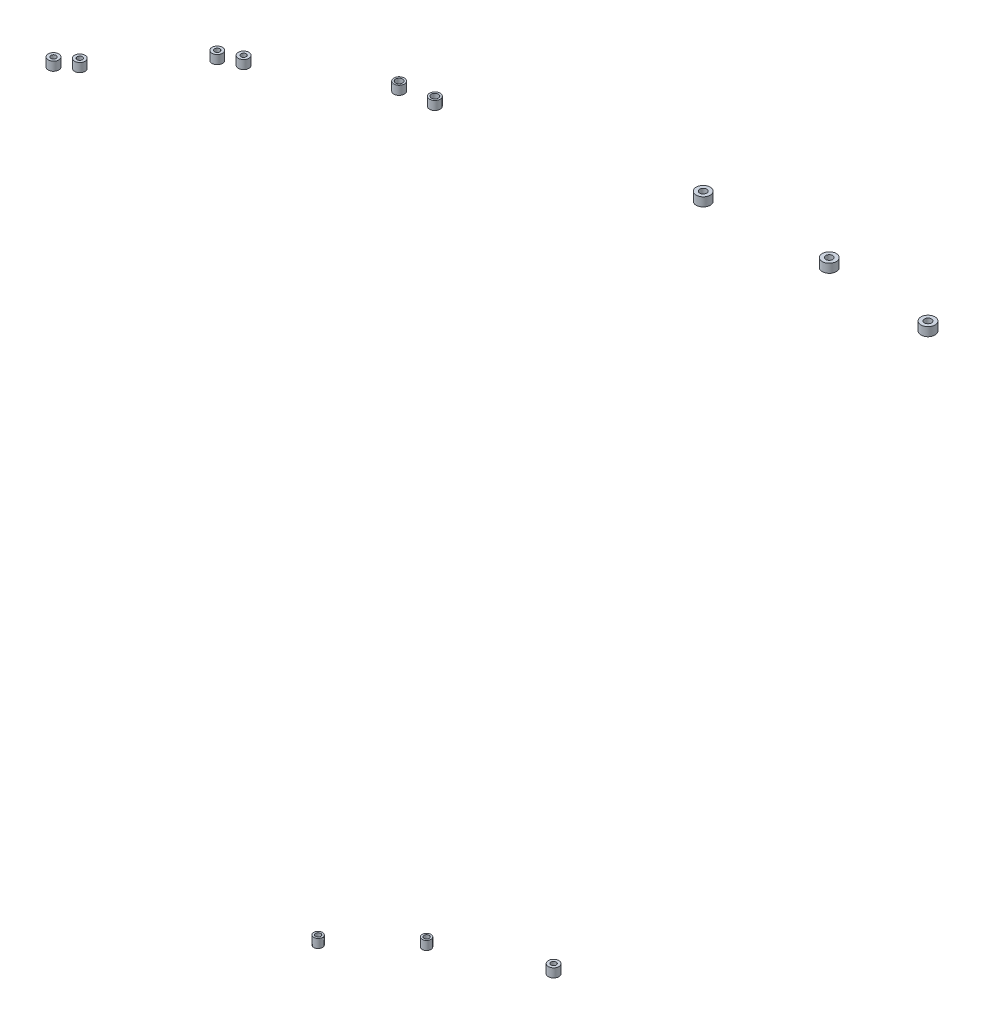
ISO-10303-21;
HEADER;
FILE_DESCRIPTION(('STEP AP214'),'2;1');
FILE_NAME('part.step','',(''),(''),'','','');
FILE_SCHEMA(('AUTOMOTIVE_DESIGN { 1 0 10303 214 1 1 1 1 }'));
ENDSEC;
DATA;
#1=APPLICATION_CONTEXT('core data for automotive mechanical design processes');
#2=APPLICATION_PROTOCOL_DEFINITION('international standard','automotive_design',2000,#1);
#3=PRODUCT_CONTEXT('',#1,'mechanical');
#4=PRODUCT('Part','Part','',(#3));
#5=PRODUCT_RELATED_PRODUCT_CATEGORY('part','',(#4));
#6=PRODUCT_DEFINITION_FORMATION('','',#4);
#7=PRODUCT_DEFINITION_CONTEXT('part definition',#1,'design');
#8=PRODUCT_DEFINITION('design','',#6,#7);
#9=PRODUCT_DEFINITION_SHAPE('','',#8);
#10=(LENGTH_UNIT() NAMED_UNIT(*) SI_UNIT(.MILLI.,.METRE.));
#11=(NAMED_UNIT(*) PLANE_ANGLE_UNIT() SI_UNIT($,.RADIAN.));
#12=(NAMED_UNIT(*) SI_UNIT($,.STERADIAN.) SOLID_ANGLE_UNIT());
#13=UNCERTAINTY_MEASURE_WITH_UNIT(LENGTH_MEASURE(1.E-05),#10,'distance_accuracy_value','');
#14=(GEOMETRIC_REPRESENTATION_CONTEXT(3) GLOBAL_UNCERTAINTY_ASSIGNED_CONTEXT((#13)) GLOBAL_UNIT_ASSIGNED_CONTEXT((#10,
#11,#12)) REPRESENTATION_CONTEXT('',''));
#15=CARTESIAN_POINT('',(0.,0.,0.));
#16=DIRECTION('',(0.,0.,1.));
#17=DIRECTION('',(1.,0.,0.));
#18=AXIS2_PLACEMENT_3D('',#15,#16,#17);
#19=CARTESIAN_POINT('',(-339.082998520851,299.7,305.429754445409));
#20=DIRECTION('',(0.,-1.,0.));
#21=DIRECTION('',(0.,0.,-1.));
#22=AXIS2_PLACEMENT_3D('',#19,#20,#21);
#23=CYLINDRICAL_SURFACE('',#22,2.50000000000002);
#24=CARTESIAN_POINT('',(-339.082998520851,299.7,305.429754445409));
#25=DIRECTION('',(0.,-1.,0.));
#26=DIRECTION('',(0.,0.,-1.));
#27=AXIS2_PLACEMENT_3D('',#24,#25,#26);
#28=CIRCLE('',#27,2.50000000000002);
#29=CARTESIAN_POINT('',(-339.082998520851,299.7,302.929754445409));
#30=VERTEX_POINT('',#29);
#31=EDGE_CURVE('E11',#30,#30,#28,.T.);
#32=ORIENTED_EDGE('',*,*,#31,.T.);
#33=EDGE_LOOP('',(#32));
#34=FACE_BOUND('',#33,.T.);
#35=CARTESIAN_POINT('',(-339.082998520851,294.7,305.429754445409));
#36=DIRECTION('',(0.,-1.,0.));
#37=DIRECTION('',(0.,0.,-1.));
#38=AXIS2_PLACEMENT_3D('',#35,#36,#37);
#39=CIRCLE('',#38,2.50000000000002);
#40=CARTESIAN_POINT('',(-339.082998520851,294.7,302.929754445409));
#41=VERTEX_POINT('',#40);
#42=EDGE_CURVE('E44',#41,#41,#39,.T.);
#43=ORIENTED_EDGE('',*,*,#42,.F.);
#44=EDGE_LOOP('',(#43));
#45=FACE_BOUND('',#44,.T.);
#46=ADVANCED_FACE('F41',(#34,#45),#23,.T.);
#47=CARTESIAN_POINT('',(-339.082998520851,299.7,305.429754445409));
#48=DIRECTION('',(0.,-1.,0.));
#49=DIRECTION('',(0.,0.,-1.));
#50=AXIS2_PLACEMENT_3D('',#47,#48,#49);
#51=PLANE('',#50);
#52=CARTESIAN_POINT('',(-339.082998520851,299.7,305.429754445409));
#53=DIRECTION('',(0.,-1.,0.));
#54=DIRECTION('',(0.,0.,-1.));
#55=AXIS2_PLACEMENT_3D('',#52,#53,#54);
#56=CIRCLE('',#55,1.50000000000002);
#57=CARTESIAN_POINT('',(-339.082998520851,299.7,303.929754445409));
#58=VERTEX_POINT('',#57);
#59=EDGE_CURVE('E51',#58,#58,#56,.T.);
#60=ORIENTED_EDGE('',*,*,#59,.T.);
#61=EDGE_LOOP('',(#60));
#62=FACE_BOUND('',#61,.T.);
#63=ORIENTED_EDGE('',*,*,#31,.F.);
#64=EDGE_LOOP('',(#63));
#65=FACE_BOUND('',#64,.T.);
#66=ADVANCED_FACE('F59',(#62,#65),#51,.F.);
#67=CARTESIAN_POINT('',(-339.082998520851,294.7,305.429754445409));
#68=DIRECTION('',(0.,-1.,0.));
#69=DIRECTION('',(0.,0.,-1.));
#70=AXIS2_PLACEMENT_3D('',#67,#68,#69);
#71=PLANE('',#70);
#72=CARTESIAN_POINT('',(-339.082998520851,294.7,305.429754445409));
#73=DIRECTION('',(0.,-1.,0.));
#74=DIRECTION('',(0.,0.,-1.));
#75=AXIS2_PLACEMENT_3D('',#72,#73,#74);
#76=CIRCLE('',#75,1.50000000000002);
#77=CARTESIAN_POINT('',(-339.082998520851,294.7,303.929754445409));
#78=VERTEX_POINT('',#77);
#79=EDGE_CURVE('E53',#78,#78,#76,.T.);
#80=ORIENTED_EDGE('',*,*,#79,.F.);
#81=EDGE_LOOP('',(#80));
#82=FACE_BOUND('',#81,.T.);
#83=ORIENTED_EDGE('',*,*,#42,.T.);
#84=EDGE_LOOP('',(#83));
#85=FACE_BOUND('',#84,.T.);
#86=ADVANCED_FACE('F65',(#82,#85),#71,.T.);
#87=CARTESIAN_POINT('',(-339.082998520851,299.7,305.429754445409));
#88=DIRECTION('',(0.,-1.,0.));
#89=DIRECTION('',(0.,0.,-1.));
#90=AXIS2_PLACEMENT_3D('',#87,#88,#89);
#91=CYLINDRICAL_SURFACE('',#90,1.50000000000002);
#92=ORIENTED_EDGE('',*,*,#59,.F.);
#93=EDGE_LOOP('',(#92));
#94=FACE_BOUND('',#93,.T.);
#95=ORIENTED_EDGE('',*,*,#79,.T.);
#96=EDGE_LOOP('',(#95));
#97=FACE_BOUND('',#96,.T.);
#98=ADVANCED_FACE('F62',(#94,#97),#91,.F.);
#99=CLOSED_SHELL('',(#46,#66,#86,#98));
#100=MANIFOLD_SOLID_BREP('B2',#99);
#101=CARTESIAN_POINT('',(-289.687055909534,299.7,282.424125212571));
#102=DIRECTION('',(0.,-1.,0.));
#103=DIRECTION('',(0.,0.,-1.));
#104=AXIS2_PLACEMENT_3D('',#101,#102,#103);
#105=CYLINDRICAL_SURFACE('',#104,2.99999999999999);
#106=CARTESIAN_POINT('',(-289.687055909534,299.7,282.424125212571));
#107=DIRECTION('',(0.,-1.,0.));
#108=DIRECTION('',(0.,0.,-1.));
#109=AXIS2_PLACEMENT_3D('',#106,#107,#108);
#110=CIRCLE('',#109,2.99999999999999);
#111=CARTESIAN_POINT('',(-289.687055909534,299.7,279.424125212571));
#112=VERTEX_POINT('',#111);
#113=EDGE_CURVE('E40',#112,#112,#110,.T.);
#114=ORIENTED_EDGE('',*,*,#113,.T.);
#115=EDGE_LOOP('',(#114));
#116=FACE_BOUND('',#115,.T.);
#117=CARTESIAN_POINT('',(-289.687055909534,294.7,282.424125212571));
#118=DIRECTION('',(0.,-1.,0.));
#119=DIRECTION('',(0.,0.,-1.));
#120=AXIS2_PLACEMENT_3D('',#117,#118,#119);
#121=CIRCLE('',#120,2.99999999999999);
#122=CARTESIAN_POINT('',(-289.687055909534,294.7,279.424125212571));
#123=VERTEX_POINT('',#122);
#124=EDGE_CURVE('E113',#123,#123,#121,.T.);
#125=ORIENTED_EDGE('',*,*,#124,.F.);
#126=EDGE_LOOP('',(#125));
#127=FACE_BOUND('',#126,.T.);
#128=ADVANCED_FACE('F110',(#116,#127),#105,.T.);
#129=CARTESIAN_POINT('',(-289.687055909534,299.7,282.424125212571));
#130=DIRECTION('',(0.,-1.,0.));
#131=DIRECTION('',(0.,0.,-1.));
#132=AXIS2_PLACEMENT_3D('',#129,#130,#131);
#133=PLANE('',#132);
#134=CARTESIAN_POINT('',(-289.687055909534,299.7,282.424125212571));
#135=DIRECTION('',(0.,-1.,0.));
#136=DIRECTION('',(0.,0.,-1.));
#137=AXIS2_PLACEMENT_3D('',#134,#135,#136);
#138=CIRCLE('',#137,1.50000000000002);
#139=CARTESIAN_POINT('',(-289.687055909534,299.7,280.924125212571));
#140=VERTEX_POINT('',#139);
#141=EDGE_CURVE('E120',#140,#140,#138,.T.);
#142=ORIENTED_EDGE('',*,*,#141,.T.);
#143=EDGE_LOOP('',(#142));
#144=FACE_BOUND('',#143,.T.);
#145=ORIENTED_EDGE('',*,*,#113,.F.);
#146=EDGE_LOOP('',(#145));
#147=FACE_BOUND('',#146,.T.);
#148=ADVANCED_FACE('F128',(#144,#147),#133,.F.);
#149=CARTESIAN_POINT('',(-289.687055909534,294.7,282.424125212571));
#150=DIRECTION('',(0.,-1.,0.));
#151=DIRECTION('',(0.,0.,-1.));
#152=AXIS2_PLACEMENT_3D('',#149,#150,#151);
#153=PLANE('',#152);
#154=CARTESIAN_POINT('',(-289.687055909534,294.7,282.424125212571));
#155=DIRECTION('',(0.,-1.,0.));
#156=DIRECTION('',(0.,0.,-1.));
#157=AXIS2_PLACEMENT_3D('',#154,#155,#156);
#158=CIRCLE('',#157,1.50000000000002);
#159=CARTESIAN_POINT('',(-289.687055909534,294.7,280.924125212571));
#160=VERTEX_POINT('',#159);
#161=EDGE_CURVE('E122',#160,#160,#158,.T.);
#162=ORIENTED_EDGE('',*,*,#161,.F.);
#163=EDGE_LOOP('',(#162));
#164=FACE_BOUND('',#163,.T.);
#165=ORIENTED_EDGE('',*,*,#124,.T.);
#166=EDGE_LOOP('',(#165));
#167=FACE_BOUND('',#166,.T.);
#168=ADVANCED_FACE('F134',(#164,#167),#153,.T.);
#169=CARTESIAN_POINT('',(-289.687055909534,299.7,282.424125212571));
#170=DIRECTION('',(0.,-1.,0.));
#171=DIRECTION('',(0.,0.,-1.));
#172=AXIS2_PLACEMENT_3D('',#169,#170,#171);
#173=CYLINDRICAL_SURFACE('',#172,1.50000000000002);
#174=ORIENTED_EDGE('',*,*,#141,.F.);
#175=EDGE_LOOP('',(#174));
#176=FACE_BOUND('',#175,.T.);
#177=ORIENTED_EDGE('',*,*,#161,.T.);
#178=EDGE_LOOP('',(#177));
#179=FACE_BOUND('',#178,.T.);
#180=ADVANCED_FACE('F131',(#176,#179),#173,.F.);
#181=CLOSED_SHELL('',(#128,#148,#168,#180));
#182=MANIFOLD_SOLID_BREP('B6',#181);
#183=CARTESIAN_POINT('',(-370.956911026411,299.7,335.367132453118));
#184=DIRECTION('',(0.,-1.,0.));
#185=DIRECTION('',(0.,0.,-1.));
#186=AXIS2_PLACEMENT_3D('',#183,#184,#185);
#187=CYLINDRICAL_SURFACE('',#186,2.50000000000002);
#188=CARTESIAN_POINT('',(-370.956911026411,299.7,335.367132453118));
#189=DIRECTION('',(0.,-1.,0.));
#190=DIRECTION('',(0.,0.,-1.));
#191=AXIS2_PLACEMENT_3D('',#188,#189,#190);
#192=CIRCLE('',#191,2.50000000000002);
#193=CARTESIAN_POINT('',(-370.956911026411,299.7,332.867132453118));
#194=VERTEX_POINT('',#193);
#195=EDGE_CURVE('E109',#194,#194,#192,.T.);
#196=ORIENTED_EDGE('',*,*,#195,.T.);
#197=EDGE_LOOP('',(#196));
#198=FACE_BOUND('',#197,.T.);
#199=CARTESIAN_POINT('',(-370.956911026411,294.7,335.367132453118));
#200=DIRECTION('',(0.,-1.,0.));
#201=DIRECTION('',(0.,0.,-1.));
#202=AXIS2_PLACEMENT_3D('',#199,#200,#201);
#203=CIRCLE('',#202,2.50000000000002);
#204=CARTESIAN_POINT('',(-370.956911026411,294.7,332.867132453118));
#205=VERTEX_POINT('',#204);
#206=EDGE_CURVE('E182',#205,#205,#203,.T.);
#207=ORIENTED_EDGE('',*,*,#206,.F.);
#208=EDGE_LOOP('',(#207));
#209=FACE_BOUND('',#208,.T.);
#210=ADVANCED_FACE('F179',(#198,#209),#187,.T.);
#211=CARTESIAN_POINT('',(-370.956911026411,299.7,335.367132453118));
#212=DIRECTION('',(0.,-1.,0.));
#213=DIRECTION('',(0.,0.,-1.));
#214=AXIS2_PLACEMENT_3D('',#211,#212,#213);
#215=PLANE('',#214);
#216=CARTESIAN_POINT('',(-370.956911026411,299.7,335.367132453118));
#217=DIRECTION('',(0.,-1.,0.));
#218=DIRECTION('',(0.,0.,-1.));
#219=AXIS2_PLACEMENT_3D('',#216,#217,#218);
#220=CIRCLE('',#219,1.50000000000002);
#221=CARTESIAN_POINT('',(-370.956911026411,299.7,333.867132453118));
#222=VERTEX_POINT('',#221);
#223=EDGE_CURVE('E189',#222,#222,#220,.T.);
#224=ORIENTED_EDGE('',*,*,#223,.T.);
#225=EDGE_LOOP('',(#224));
#226=FACE_BOUND('',#225,.T.);
#227=ORIENTED_EDGE('',*,*,#195,.F.);
#228=EDGE_LOOP('',(#227));
#229=FACE_BOUND('',#228,.T.);
#230=ADVANCED_FACE('F197',(#226,#229),#215,.F.);
#231=CARTESIAN_POINT('',(-370.956911026411,294.7,335.367132453118));
#232=DIRECTION('',(0.,-1.,0.));
#233=DIRECTION('',(0.,0.,-1.));
#234=AXIS2_PLACEMENT_3D('',#231,#232,#233);
#235=PLANE('',#234);
#236=CARTESIAN_POINT('',(-370.956911026411,294.7,335.367132453118));
#237=DIRECTION('',(0.,-1.,0.));
#238=DIRECTION('',(0.,0.,-1.));
#239=AXIS2_PLACEMENT_3D('',#236,#237,#238);
#240=CIRCLE('',#239,1.50000000000002);
#241=CARTESIAN_POINT('',(-370.956911026411,294.7,333.867132453118));
#242=VERTEX_POINT('',#241);
#243=EDGE_CURVE('E191',#242,#242,#240,.T.);
#244=ORIENTED_EDGE('',*,*,#243,.F.);
#245=EDGE_LOOP('',(#244));
#246=FACE_BOUND('',#245,.T.);
#247=ORIENTED_EDGE('',*,*,#206,.T.);
#248=EDGE_LOOP('',(#247));
#249=FACE_BOUND('',#248,.T.);
#250=ADVANCED_FACE('F203',(#246,#249),#235,.T.);
#251=CARTESIAN_POINT('',(-370.956911026411,299.7,335.367132453118));
#252=DIRECTION('',(0.,-1.,0.));
#253=DIRECTION('',(0.,0.,-1.));
#254=AXIS2_PLACEMENT_3D('',#251,#252,#253);
#255=CYLINDRICAL_SURFACE('',#254,1.50000000000002);
#256=ORIENTED_EDGE('',*,*,#223,.F.);
#257=EDGE_LOOP('',(#256));
#258=FACE_BOUND('',#257,.T.);
#259=ORIENTED_EDGE('',*,*,#243,.T.);
#260=EDGE_LOOP('',(#259));
#261=FACE_BOUND('',#260,.T.);
#262=ADVANCED_FACE('F200',(#258,#261),#255,.F.);
#263=CLOSED_SHELL('',(#210,#230,#250,#262));
#264=MANIFOLD_SOLID_BREP('B35',#263);
#265=CARTESIAN_POINT('',(-94.9095215443751,705.,263.802212935845));
#266=DIRECTION('',(0.,1.,0.));
#267=DIRECTION('',(0.,0.,1.));
#268=AXIS2_PLACEMENT_3D('',#265,#266,#267);
#269=PLANE('',#268);
#270=CARTESIAN_POINT('',(-94.9095215443751,705.,263.802212935845));
#271=DIRECTION('',(0.,1.,0.));
#272=DIRECTION('',(0.,0.,1.));
#273=AXIS2_PLACEMENT_3D('',#270,#271,#272);
#274=CIRCLE('',#273,4.00000000000001);
#275=CARTESIAN_POINT('',(-94.9095215443751,705.,267.802212935845));
#276=VERTEX_POINT('',#275);
#277=EDGE_CURVE('E178',#276,#276,#274,.T.);
#278=ORIENTED_EDGE('',*,*,#277,.T.);
#279=EDGE_LOOP('',(#278));
#280=FACE_BOUND('',#279,.T.);
#281=CARTESIAN_POINT('',(-94.9095215443751,705.,263.802212935845));
#282=DIRECTION('',(0.,1.,0.));
#283=DIRECTION('',(0.,0.,1.));
#284=AXIS2_PLACEMENT_3D('',#281,#282,#283);
#285=CIRCLE('',#284,2.);
#286=CARTESIAN_POINT('',(-94.9095215443751,705.,265.802212935845));
#287=VERTEX_POINT('',#286);
#288=EDGE_CURVE('E259',#287,#287,#285,.T.);
#289=ORIENTED_EDGE('',*,*,#288,.F.);
#290=EDGE_LOOP('',(#289));
#291=FACE_BOUND('',#290,.T.);
#292=ADVANCED_FACE('F248',(#280,#291),#269,.T.);
#293=CARTESIAN_POINT('',(-94.9095215443751,700.,263.802212935845));
#294=DIRECTION('',(0.,1.,0.));
#295=DIRECTION('',(0.,0.,1.));
#296=AXIS2_PLACEMENT_3D('',#293,#294,#295);
#297=PLANE('',#296);
#298=CARTESIAN_POINT('',(-94.9095215443751,700.,263.802212935845));
#299=DIRECTION('',(0.,1.,0.));
#300=DIRECTION('',(0.,0.,1.));
#301=AXIS2_PLACEMENT_3D('',#298,#299,#300);
#302=CIRCLE('',#301,4.00000000000001);
#303=CARTESIAN_POINT('',(-94.9095215443751,700.,267.802212935845));
#304=VERTEX_POINT('',#303);
#305=EDGE_CURVE('E252',#304,#304,#302,.T.);
#306=ORIENTED_EDGE('',*,*,#305,.F.);
#307=EDGE_LOOP('',(#306));
#308=FACE_BOUND('',#307,.T.);
#309=CARTESIAN_POINT('',(-94.9095215443751,700.,263.802212935845));
#310=DIRECTION('',(0.,1.,0.));
#311=DIRECTION('',(0.,0.,1.));
#312=AXIS2_PLACEMENT_3D('',#309,#310,#311);
#313=CIRCLE('',#312,2.);
#314=CARTESIAN_POINT('',(-94.9095215443751,700.,265.802212935845));
#315=VERTEX_POINT('',#314);
#316=EDGE_CURVE('E261',#315,#315,#313,.T.);
#317=ORIENTED_EDGE('',*,*,#316,.T.);
#318=EDGE_LOOP('',(#317));
#319=FACE_BOUND('',#318,.T.);
#320=ADVANCED_FACE('F271',(#308,#319),#297,.F.);
#321=CARTESIAN_POINT('',(-94.9095215443751,705.,263.802212935845));
#322=DIRECTION('',(0.,-1.,0.));
#323=DIRECTION('',(0.,0.,-1.));
#324=AXIS2_PLACEMENT_3D('',#321,#322,#323);
#325=CYLINDRICAL_SURFACE('',#324,4.00000000000001);
#326=ORIENTED_EDGE('',*,*,#277,.F.);
#327=EDGE_LOOP('',(#326));
#328=FACE_BOUND('',#327,.T.);
#329=ORIENTED_EDGE('',*,*,#305,.T.);
#330=EDGE_LOOP('',(#329));
#331=FACE_BOUND('',#330,.T.);
#332=ADVANCED_FACE('F250',(#328,#331),#325,.T.);
#333=CARTESIAN_POINT('',(-94.9095215443751,705.,263.802212935845));
#334=DIRECTION('',(0.,-1.,0.));
#335=DIRECTION('',(0.,0.,-1.));
#336=AXIS2_PLACEMENT_3D('',#333,#334,#335);
#337=CYLINDRICAL_SURFACE('',#336,2.);
#338=ORIENTED_EDGE('',*,*,#288,.T.);
#339=EDGE_LOOP('',(#338));
#340=FACE_BOUND('',#339,.T.);
#341=ORIENTED_EDGE('',*,*,#316,.F.);
#342=EDGE_LOOP('',(#341));
#343=FACE_BOUND('',#342,.T.);
#344=ADVANCED_FACE('F267',(#340,#343),#337,.F.);
#345=CLOSED_SHELL('',(#292,#320,#332,#344));
#346=MANIFOLD_SOLID_BREP('B104',#345);
#347=CARTESIAN_POINT('',(-154.344703344319,705.,260.643821632466));
#348=DIRECTION('',(0.,1.,0.));
#349=DIRECTION('',(0.,0.,1.));
#350=AXIS2_PLACEMENT_3D('',#347,#348,#349);
#351=PLANE('',#350);
#352=CARTESIAN_POINT('',(-154.344703344319,705.,260.643821632466));
#353=DIRECTION('',(0.,1.,0.));
#354=DIRECTION('',(0.,0.,1.));
#355=AXIS2_PLACEMENT_3D('',#352,#353,#354);
#356=CIRCLE('',#355,3.99999999999999);
#357=CARTESIAN_POINT('',(-154.344703344319,705.,264.643821632466));
#358=VERTEX_POINT('',#357);
#359=EDGE_CURVE('E247',#358,#358,#356,.T.);
#360=ORIENTED_EDGE('',*,*,#359,.T.);
#361=EDGE_LOOP('',(#360));
#362=FACE_BOUND('',#361,.T.);
#363=CARTESIAN_POINT('',(-154.344703344319,705.,260.643821632466));
#364=DIRECTION('',(0.,1.,0.));
#365=DIRECTION('',(0.,0.,1.));
#366=AXIS2_PLACEMENT_3D('',#363,#364,#365);
#367=CIRCLE('',#366,2.);
#368=CARTESIAN_POINT('',(-154.344703344319,705.,262.643821632466));
#369=VERTEX_POINT('',#368);
#370=EDGE_CURVE('E328',#369,#369,#367,.T.);
#371=ORIENTED_EDGE('',*,*,#370,.F.);
#372=EDGE_LOOP('',(#371));
#373=FACE_BOUND('',#372,.T.);
#374=ADVANCED_FACE('F317',(#362,#373),#351,.T.);
#375=CARTESIAN_POINT('',(-154.344703344319,700.,260.643821632466));
#376=DIRECTION('',(0.,1.,0.));
#377=DIRECTION('',(0.,0.,1.));
#378=AXIS2_PLACEMENT_3D('',#375,#376,#377);
#379=PLANE('',#378);
#380=CARTESIAN_POINT('',(-154.344703344319,700.,260.643821632466));
#381=DIRECTION('',(0.,1.,0.));
#382=DIRECTION('',(0.,0.,1.));
#383=AXIS2_PLACEMENT_3D('',#380,#381,#382);
#384=CIRCLE('',#383,3.99999999999999);
#385=CARTESIAN_POINT('',(-154.344703344319,700.,264.643821632466));
#386=VERTEX_POINT('',#385);
#387=EDGE_CURVE('E321',#386,#386,#384,.T.);
#388=ORIENTED_EDGE('',*,*,#387,.F.);
#389=EDGE_LOOP('',(#388));
#390=FACE_BOUND('',#389,.T.);
#391=CARTESIAN_POINT('',(-154.344703344319,700.,260.643821632466));
#392=DIRECTION('',(0.,1.,0.));
#393=DIRECTION('',(0.,0.,1.));
#394=AXIS2_PLACEMENT_3D('',#391,#392,#393);
#395=CIRCLE('',#394,2.);
#396=CARTESIAN_POINT('',(-154.344703344319,700.,262.643821632466));
#397=VERTEX_POINT('',#396);
#398=EDGE_CURVE('E330',#397,#397,#395,.T.);
#399=ORIENTED_EDGE('',*,*,#398,.T.);
#400=EDGE_LOOP('',(#399));
#401=FACE_BOUND('',#400,.T.);
#402=ADVANCED_FACE('F340',(#390,#401),#379,.F.);
#403=CARTESIAN_POINT('',(-154.344703344319,705.,260.643821632466));
#404=DIRECTION('',(0.,-1.,0.));
#405=DIRECTION('',(0.,0.,-1.));
#406=AXIS2_PLACEMENT_3D('',#403,#404,#405);
#407=CYLINDRICAL_SURFACE('',#406,3.99999999999999);
#408=ORIENTED_EDGE('',*,*,#359,.F.);
#409=EDGE_LOOP('',(#408));
#410=FACE_BOUND('',#409,.T.);
#411=ORIENTED_EDGE('',*,*,#387,.T.);
#412=EDGE_LOOP('',(#411));
#413=FACE_BOUND('',#412,.T.);
#414=ADVANCED_FACE('F319',(#410,#413),#407,.T.);
#415=CARTESIAN_POINT('',(-154.344703344319,705.,260.643821632466));
#416=DIRECTION('',(0.,-1.,0.));
#417=DIRECTION('',(0.,0.,-1.));
#418=AXIS2_PLACEMENT_3D('',#415,#416,#417);
#419=CYLINDRICAL_SURFACE('',#418,2.);
#420=ORIENTED_EDGE('',*,*,#370,.T.);
#421=EDGE_LOOP('',(#420));
#422=FACE_BOUND('',#421,.T.);
#423=ORIENTED_EDGE('',*,*,#398,.F.);
#424=EDGE_LOOP('',(#423));
#425=FACE_BOUND('',#424,.T.);
#426=ADVANCED_FACE('F336',(#422,#425),#419,.F.);
#427=CLOSED_SHELL('',(#374,#402,#414,#426));
#428=MANIFOLD_SOLID_BREP('B173',#427);
#429=CARTESIAN_POINT('',(-223.024834580686,705.,263.802212935845));
#430=DIRECTION('',(0.,1.,0.));
#431=DIRECTION('',(0.,0.,1.));
#432=AXIS2_PLACEMENT_3D('',#429,#430,#431);
#433=PLANE('',#432);
#434=CARTESIAN_POINT('',(-223.024834580686,705.,263.802212935845));
#435=DIRECTION('',(0.,1.,0.));
#436=DIRECTION('',(0.,0.,1.));
#437=AXIS2_PLACEMENT_3D('',#434,#435,#436);
#438=CIRCLE('',#437,3.99999999999999);
#439=CARTESIAN_POINT('',(-223.024834580686,705.,267.802212935845));
#440=VERTEX_POINT('',#439);
#441=EDGE_CURVE('E316',#440,#440,#438,.T.);
#442=ORIENTED_EDGE('',*,*,#441,.T.);
#443=EDGE_LOOP('',(#442));
#444=FACE_BOUND('',#443,.T.);
#445=CARTESIAN_POINT('',(-223.024834580686,705.,263.802212935845));
#446=DIRECTION('',(0.,1.,0.));
#447=DIRECTION('',(0.,0.,1.));
#448=AXIS2_PLACEMENT_3D('',#445,#446,#447);
#449=CIRCLE('',#448,2.);
#450=CARTESIAN_POINT('',(-223.024834580686,705.,265.802212935845));
#451=VERTEX_POINT('',#450);
#452=EDGE_CURVE('E397',#451,#451,#449,.T.);
#453=ORIENTED_EDGE('',*,*,#452,.F.);
#454=EDGE_LOOP('',(#453));
#455=FACE_BOUND('',#454,.T.);
#456=ADVANCED_FACE('F386',(#444,#455),#433,.T.);
#457=CARTESIAN_POINT('',(-223.024834580686,700.,263.802212935845));
#458=DIRECTION('',(0.,1.,0.));
#459=DIRECTION('',(0.,0.,1.));
#460=AXIS2_PLACEMENT_3D('',#457,#458,#459);
#461=PLANE('',#460);
#462=CARTESIAN_POINT('',(-223.024834580686,700.,263.802212935845));
#463=DIRECTION('',(0.,1.,0.));
#464=DIRECTION('',(0.,0.,1.));
#465=AXIS2_PLACEMENT_3D('',#462,#463,#464);
#466=CIRCLE('',#465,3.99999999999999);
#467=CARTESIAN_POINT('',(-223.024834580686,700.,267.802212935845));
#468=VERTEX_POINT('',#467);
#469=EDGE_CURVE('E390',#468,#468,#466,.T.);
#470=ORIENTED_EDGE('',*,*,#469,.F.);
#471=EDGE_LOOP('',(#470));
#472=FACE_BOUND('',#471,.T.);
#473=CARTESIAN_POINT('',(-223.024834580686,700.,263.802212935845));
#474=DIRECTION('',(0.,1.,0.));
#475=DIRECTION('',(0.,0.,1.));
#476=AXIS2_PLACEMENT_3D('',#473,#474,#475);
#477=CIRCLE('',#476,2.);
#478=CARTESIAN_POINT('',(-223.024834580686,700.,265.802212935845));
#479=VERTEX_POINT('',#478);
#480=EDGE_CURVE('E399',#479,#479,#477,.T.);
#481=ORIENTED_EDGE('',*,*,#480,.T.);
#482=EDGE_LOOP('',(#481));
#483=FACE_BOUND('',#482,.T.);
#484=ADVANCED_FACE('F409',(#472,#483),#461,.F.);
#485=CARTESIAN_POINT('',(-223.024834580686,705.,263.802212935845));
#486=DIRECTION('',(0.,-1.,0.));
#487=DIRECTION('',(0.,0.,-1.));
#488=AXIS2_PLACEMENT_3D('',#485,#486,#487);
#489=CYLINDRICAL_SURFACE('',#488,3.99999999999999);
#490=ORIENTED_EDGE('',*,*,#441,.F.);
#491=EDGE_LOOP('',(#490));
#492=FACE_BOUND('',#491,.T.);
#493=ORIENTED_EDGE('',*,*,#469,.T.);
#494=EDGE_LOOP('',(#493));
#495=FACE_BOUND('',#494,.T.);
#496=ADVANCED_FACE('F388',(#492,#495),#489,.T.);
#497=CARTESIAN_POINT('',(-223.024834580686,705.,263.802212935845));
#498=DIRECTION('',(0.,-1.,0.));
#499=DIRECTION('',(0.,0.,-1.));
#500=AXIS2_PLACEMENT_3D('',#497,#498,#499);
#501=CYLINDRICAL_SURFACE('',#500,2.);
#502=ORIENTED_EDGE('',*,*,#452,.T.);
#503=EDGE_LOOP('',(#502));
#504=FACE_BOUND('',#503,.T.);
#505=ORIENTED_EDGE('',*,*,#480,.F.);
#506=EDGE_LOOP('',(#505));
#507=FACE_BOUND('',#506,.T.);
#508=ADVANCED_FACE('F405',(#504,#507),#501,.F.);
#509=CLOSED_SHELL('',(#456,#484,#496,#508));
#510=MANIFOLD_SOLID_BREP('B242',#509);
#511=CARTESIAN_POINT('',(-346.389872513205,705.,293.396246383283));
#512=DIRECTION('',(0.,1.,0.));
#513=DIRECTION('',(0.,0.,1.));
#514=AXIS2_PLACEMENT_3D('',#511,#512,#513);
#515=PLANE('',#514);
#516=CARTESIAN_POINT('',(-346.389872513205,705.,293.396246383283));
#517=DIRECTION('',(0.,1.,0.));
#518=DIRECTION('',(0.,0.,1.));
#519=AXIS2_PLACEMENT_3D('',#516,#517,#518);
#520=CIRCLE('',#519,2.99999999999999);
#521=CARTESIAN_POINT('',(-346.389872513205,705.,296.396246383283));
#522=VERTEX_POINT('',#521);
#523=EDGE_CURVE('E385',#522,#522,#520,.T.);
#524=ORIENTED_EDGE('',*,*,#523,.T.);
#525=EDGE_LOOP('',(#524));
#526=FACE_BOUND('',#525,.T.);
#527=CARTESIAN_POINT('',(-346.389872513205,705.,293.396246383283));
#528=DIRECTION('',(0.,1.,0.));
#529=DIRECTION('',(0.,0.,1.));
#530=AXIS2_PLACEMENT_3D('',#527,#528,#529);
#531=CIRCLE('',#530,2.);
#532=CARTESIAN_POINT('',(-346.389872513205,705.,295.396246383283));
#533=VERTEX_POINT('',#532);
#534=EDGE_CURVE('E466',#533,#533,#531,.T.);
#535=ORIENTED_EDGE('',*,*,#534,.F.);
#536=EDGE_LOOP('',(#535));
#537=FACE_BOUND('',#536,.T.);
#538=ADVANCED_FACE('F455',(#526,#537),#515,.T.);
#539=CARTESIAN_POINT('',(-346.389872513205,700.,293.396246383283));
#540=DIRECTION('',(0.,1.,0.));
#541=DIRECTION('',(0.,0.,1.));
#542=AXIS2_PLACEMENT_3D('',#539,#540,#541);
#543=PLANE('',#542);
#544=CARTESIAN_POINT('',(-346.389872513205,700.,293.396246383283));
#545=DIRECTION('',(0.,1.,0.));
#546=DIRECTION('',(0.,0.,1.));
#547=AXIS2_PLACEMENT_3D('',#544,#545,#546);
#548=CIRCLE('',#547,2.99999999999999);
#549=CARTESIAN_POINT('',(-346.389872513205,700.,296.396246383283));
#550=VERTEX_POINT('',#549);
#551=EDGE_CURVE('E459',#550,#550,#548,.T.);
#552=ORIENTED_EDGE('',*,*,#551,.F.);
#553=EDGE_LOOP('',(#552));
#554=FACE_BOUND('',#553,.T.);
#555=CARTESIAN_POINT('',(-346.389872513205,700.,293.396246383283));
#556=DIRECTION('',(0.,1.,0.));
#557=DIRECTION('',(0.,0.,1.));
#558=AXIS2_PLACEMENT_3D('',#555,#556,#557);
#559=CIRCLE('',#558,2.);
#560=CARTESIAN_POINT('',(-346.389872513205,700.,295.396246383283));
#561=VERTEX_POINT('',#560);
#562=EDGE_CURVE('E468',#561,#561,#559,.T.);
#563=ORIENTED_EDGE('',*,*,#562,.T.);
#564=EDGE_LOOP('',(#563));
#565=FACE_BOUND('',#564,.T.);
#566=ADVANCED_FACE('F478',(#554,#565),#543,.F.);
#567=CARTESIAN_POINT('',(-346.389872513205,705.,293.396246383283));
#568=DIRECTION('',(0.,-1.,0.));
#569=DIRECTION('',(0.,0.,-1.));
#570=AXIS2_PLACEMENT_3D('',#567,#568,#569);
#571=CYLINDRICAL_SURFACE('',#570,2.99999999999999);
#572=ORIENTED_EDGE('',*,*,#523,.F.);
#573=EDGE_LOOP('',(#572));
#574=FACE_BOUND('',#573,.T.);
#575=ORIENTED_EDGE('',*,*,#551,.T.);
#576=EDGE_LOOP('',(#575));
#577=FACE_BOUND('',#576,.T.);
#578=ADVANCED_FACE('F457',(#574,#577),#571,.T.);
#579=CARTESIAN_POINT('',(-346.389872513205,705.,293.396246383283));
#580=DIRECTION('',(0.,-1.,0.));
#581=DIRECTION('',(0.,0.,-1.));
#582=AXIS2_PLACEMENT_3D('',#579,#580,#581);
#583=CYLINDRICAL_SURFACE('',#582,2.);
#584=ORIENTED_EDGE('',*,*,#534,.T.);
#585=EDGE_LOOP('',(#584));
#586=FACE_BOUND('',#585,.T.);
#587=ORIENTED_EDGE('',*,*,#562,.F.);
#588=EDGE_LOOP('',(#587));
#589=FACE_BOUND('',#588,.T.);
#590=ADVANCED_FACE('F474',(#586,#589),#583,.F.);
#591=CLOSED_SHELL('',(#538,#566,#578,#590));
#592=MANIFOLD_SOLID_BREP('B311',#591);
#593=CARTESIAN_POINT('',(-364.051137420954,705.,296.101801858513));
#594=DIRECTION('',(0.,1.,0.));
#595=DIRECTION('',(0.,0.,1.));
#596=AXIS2_PLACEMENT_3D('',#593,#594,#595);
#597=PLANE('',#596);
#598=CARTESIAN_POINT('',(-364.051137420954,705.,296.101801858513));
#599=DIRECTION('',(0.,1.,0.));
#600=DIRECTION('',(0.,0.,1.));
#601=AXIS2_PLACEMENT_3D('',#598,#599,#600);
#602=CIRCLE('',#601,2.99999999999999);
#603=CARTESIAN_POINT('',(-364.051137420954,705.,299.101801858513));
#604=VERTEX_POINT('',#603);
#605=EDGE_CURVE('E454',#604,#604,#602,.T.);
#606=ORIENTED_EDGE('',*,*,#605,.T.);
#607=EDGE_LOOP('',(#606));
#608=FACE_BOUND('',#607,.T.);
#609=CARTESIAN_POINT('',(-364.051137420954,705.,296.101801858513));
#610=DIRECTION('',(0.,1.,0.));
#611=DIRECTION('',(0.,0.,1.));
#612=AXIS2_PLACEMENT_3D('',#609,#610,#611);
#613=CIRCLE('',#612,2.);
#614=CARTESIAN_POINT('',(-364.051137420954,705.,298.101801858513));
#615=VERTEX_POINT('',#614);
#616=EDGE_CURVE('E535',#615,#615,#613,.T.);
#617=ORIENTED_EDGE('',*,*,#616,.F.);
#618=EDGE_LOOP('',(#617));
#619=FACE_BOUND('',#618,.T.);
#620=ADVANCED_FACE('F524',(#608,#619),#597,.T.);
#621=CARTESIAN_POINT('',(-364.051137420954,700.,296.101801858513));
#622=DIRECTION('',(0.,1.,0.));
#623=DIRECTION('',(0.,0.,1.));
#624=AXIS2_PLACEMENT_3D('',#621,#622,#623);
#625=PLANE('',#624);
#626=CARTESIAN_POINT('',(-364.051137420954,700.,296.101801858513));
#627=DIRECTION('',(0.,1.,0.));
#628=DIRECTION('',(0.,0.,1.));
#629=AXIS2_PLACEMENT_3D('',#626,#627,#628);
#630=CIRCLE('',#629,2.99999999999999);
#631=CARTESIAN_POINT('',(-364.051137420954,700.,299.101801858513));
#632=VERTEX_POINT('',#631);
#633=EDGE_CURVE('E528',#632,#632,#630,.T.);
#634=ORIENTED_EDGE('',*,*,#633,.F.);
#635=EDGE_LOOP('',(#634));
#636=FACE_BOUND('',#635,.T.);
#637=CARTESIAN_POINT('',(-364.051137420954,700.,296.101801858513));
#638=DIRECTION('',(0.,1.,0.));
#639=DIRECTION('',(0.,0.,1.));
#640=AXIS2_PLACEMENT_3D('',#637,#638,#639);
#641=CIRCLE('',#640,2.);
#642=CARTESIAN_POINT('',(-364.051137420954,700.,298.101801858513));
#643=VERTEX_POINT('',#642);
#644=EDGE_CURVE('E537',#643,#643,#641,.T.);
#645=ORIENTED_EDGE('',*,*,#644,.T.);
#646=EDGE_LOOP('',(#645));
#647=FACE_BOUND('',#646,.T.);
#648=ADVANCED_FACE('F547',(#636,#647),#625,.F.);
#649=CARTESIAN_POINT('',(-364.051137420954,705.,296.101801858513));
#650=DIRECTION('',(0.,-1.,0.));
#651=DIRECTION('',(0.,0.,-1.));
#652=AXIS2_PLACEMENT_3D('',#649,#650,#651);
#653=CYLINDRICAL_SURFACE('',#652,2.99999999999999);
#654=ORIENTED_EDGE('',*,*,#605,.F.);
#655=EDGE_LOOP('',(#654));
#656=FACE_BOUND('',#655,.T.);
#657=ORIENTED_EDGE('',*,*,#633,.T.);
#658=EDGE_LOOP('',(#657));
#659=FACE_BOUND('',#658,.T.);
#660=ADVANCED_FACE('F526',(#656,#659),#653,.T.);
#661=CARTESIAN_POINT('',(-364.051137420954,705.,296.101801858513));
#662=DIRECTION('',(0.,-1.,0.));
#663=DIRECTION('',(0.,0.,-1.));
#664=AXIS2_PLACEMENT_3D('',#661,#662,#663);
#665=CYLINDRICAL_SURFACE('',#664,2.);
#666=ORIENTED_EDGE('',*,*,#616,.T.);
#667=EDGE_LOOP('',(#666));
#668=FACE_BOUND('',#667,.T.);
#669=ORIENTED_EDGE('',*,*,#644,.F.);
#670=EDGE_LOOP('',(#669));
#671=FACE_BOUND('',#670,.T.);
#672=ADVANCED_FACE('F543',(#668,#671),#665,.F.);
#673=CLOSED_SHELL('',(#620,#648,#660,#672));
#674=MANIFOLD_SOLID_BREP('B380',#673);
#675=CARTESIAN_POINT('',(-421.090050281492,705.,327.725114351705));
#676=DIRECTION('',(0.,1.,0.));
#677=DIRECTION('',(0.,0.,1.));
#678=AXIS2_PLACEMENT_3D('',#675,#676,#677);
#679=PLANE('',#678);
#680=CARTESIAN_POINT('',(-421.090050281492,705.,327.725114351705));
#681=DIRECTION('',(0.,1.,0.));
#682=DIRECTION('',(0.,0.,1.));
#683=AXIS2_PLACEMENT_3D('',#680,#681,#682);
#684=CIRCLE('',#683,2.99999999999999);
#685=CARTESIAN_POINT('',(-421.090050281492,705.,330.725114351705));
#686=VERTEX_POINT('',#685);
#687=EDGE_CURVE('E523',#686,#686,#684,.T.);
#688=ORIENTED_EDGE('',*,*,#687,.T.);
#689=EDGE_LOOP('',(#688));
#690=FACE_BOUND('',#689,.T.);
#691=CARTESIAN_POINT('',(-421.090050281492,705.,327.725114351705));
#692=DIRECTION('',(0.,1.,0.));
#693=DIRECTION('',(0.,0.,1.));
#694=AXIS2_PLACEMENT_3D('',#691,#692,#693);
#695=CIRCLE('',#694,1.50000000000002);
#696=CARTESIAN_POINT('',(-421.090050281492,705.,329.225114351705));
#697=VERTEX_POINT('',#696);
#698=EDGE_CURVE('E604',#697,#697,#695,.T.);
#699=ORIENTED_EDGE('',*,*,#698,.F.);
#700=EDGE_LOOP('',(#699));
#701=FACE_BOUND('',#700,.T.);
#702=ADVANCED_FACE('F593',(#690,#701),#679,.T.);
#703=CARTESIAN_POINT('',(-421.090050281492,700.,327.725114351705));
#704=DIRECTION('',(0.,1.,0.));
#705=DIRECTION('',(0.,0.,1.));
#706=AXIS2_PLACEMENT_3D('',#703,#704,#705);
#707=PLANE('',#706);
#708=CARTESIAN_POINT('',(-421.090050281492,700.,327.725114351705));
#709=DIRECTION('',(0.,1.,0.));
#710=DIRECTION('',(0.,0.,1.));
#711=AXIS2_PLACEMENT_3D('',#708,#709,#710);
#712=CIRCLE('',#711,2.99999999999999);
#713=CARTESIAN_POINT('',(-421.090050281492,700.,330.725114351705));
#714=VERTEX_POINT('',#713);
#715=EDGE_CURVE('E597',#714,#714,#712,.T.);
#716=ORIENTED_EDGE('',*,*,#715,.F.);
#717=EDGE_LOOP('',(#716));
#718=FACE_BOUND('',#717,.T.);
#719=CARTESIAN_POINT('',(-421.090050281492,700.,327.725114351705));
#720=DIRECTION('',(0.,1.,0.));
#721=DIRECTION('',(0.,0.,1.));
#722=AXIS2_PLACEMENT_3D('',#719,#720,#721);
#723=CIRCLE('',#722,1.50000000000002);
#724=CARTESIAN_POINT('',(-421.090050281492,700.,329.225114351705));
#725=VERTEX_POINT('',#724);
#726=EDGE_CURVE('E606',#725,#725,#723,.T.);
#727=ORIENTED_EDGE('',*,*,#726,.T.);
#728=EDGE_LOOP('',(#727));
#729=FACE_BOUND('',#728,.T.);
#730=ADVANCED_FACE('F616',(#718,#729),#707,.F.);
#731=CARTESIAN_POINT('',(-421.090050281492,705.,327.725114351705));
#732=DIRECTION('',(0.,-1.,0.));
#733=DIRECTION('',(0.,0.,-1.));
#734=AXIS2_PLACEMENT_3D('',#731,#732,#733);
#735=CYLINDRICAL_SURFACE('',#734,2.99999999999999);
#736=ORIENTED_EDGE('',*,*,#687,.F.);
#737=EDGE_LOOP('',(#736));
#738=FACE_BOUND('',#737,.T.);
#739=ORIENTED_EDGE('',*,*,#715,.T.);
#740=EDGE_LOOP('',(#739));
#741=FACE_BOUND('',#740,.T.);
#742=ADVANCED_FACE('F595',(#738,#741),#735,.T.);
#743=CARTESIAN_POINT('',(-421.090050281492,705.,327.725114351705));
#744=DIRECTION('',(0.,-1.,0.));
#745=DIRECTION('',(0.,0.,-1.));
#746=AXIS2_PLACEMENT_3D('',#743,#744,#745);
#747=CYLINDRICAL_SURFACE('',#746,1.50000000000002);
#748=ORIENTED_EDGE('',*,*,#698,.T.);
#749=EDGE_LOOP('',(#748));
#750=FACE_BOUND('',#749,.T.);
#751=ORIENTED_EDGE('',*,*,#726,.F.);
#752=EDGE_LOOP('',(#751));
#753=FACE_BOUND('',#752,.T.);
#754=ADVANCED_FACE('F612',(#750,#753),#747,.F.);
#755=CLOSED_SHELL('',(#702,#730,#742,#754));
#756=MANIFOLD_SOLID_BREP('B449',#755);
#757=CARTESIAN_POINT('',(-431.039698401952,705.,332.774189517311));
#758=DIRECTION('',(0.,1.,0.));
#759=DIRECTION('',(0.,0.,1.));
#760=AXIS2_PLACEMENT_3D('',#757,#758,#759);
#761=PLANE('',#760);
#762=CARTESIAN_POINT('',(-431.039698401952,705.,332.774189517311));
#763=DIRECTION('',(0.,1.,0.));
#764=DIRECTION('',(0.,0.,1.));
#765=AXIS2_PLACEMENT_3D('',#762,#763,#764);
#766=CIRCLE('',#765,2.99999999999999);
#767=CARTESIAN_POINT('',(-431.039698401952,705.,335.774189517311));
#768=VERTEX_POINT('',#767);
#769=EDGE_CURVE('E592',#768,#768,#766,.T.);
#770=ORIENTED_EDGE('',*,*,#769,.T.);
#771=EDGE_LOOP('',(#770));
#772=FACE_BOUND('',#771,.T.);
#773=CARTESIAN_POINT('',(-431.039698401952,705.,332.774189517311));
#774=DIRECTION('',(0.,1.,0.));
#775=DIRECTION('',(0.,0.,1.));
#776=AXIS2_PLACEMENT_3D('',#773,#774,#775);
#777=CIRCLE('',#776,1.50000000000002);
#778=CARTESIAN_POINT('',(-431.039698401952,705.,334.274189517311));
#779=VERTEX_POINT('',#778);
#780=EDGE_CURVE('E673',#779,#779,#777,.T.);
#781=ORIENTED_EDGE('',*,*,#780,.F.);
#782=EDGE_LOOP('',(#781));
#783=FACE_BOUND('',#782,.T.);
#784=ADVANCED_FACE('F662',(#772,#783),#761,.T.);
#785=CARTESIAN_POINT('',(-431.039698401952,700.,332.774189517311));
#786=DIRECTION('',(0.,1.,0.));
#787=DIRECTION('',(0.,0.,1.));
#788=AXIS2_PLACEMENT_3D('',#785,#786,#787);
#789=PLANE('',#788);
#790=CARTESIAN_POINT('',(-431.039698401952,700.,332.774189517311));
#791=DIRECTION('',(0.,1.,0.));
#792=DIRECTION('',(0.,0.,1.));
#793=AXIS2_PLACEMENT_3D('',#790,#791,#792);
#794=CIRCLE('',#793,2.99999999999999);
#795=CARTESIAN_POINT('',(-431.039698401952,700.,335.774189517311));
#796=VERTEX_POINT('',#795);
#797=EDGE_CURVE('E666',#796,#796,#794,.T.);
#798=ORIENTED_EDGE('',*,*,#797,.F.);
#799=EDGE_LOOP('',(#798));
#800=FACE_BOUND('',#799,.T.);
#801=CARTESIAN_POINT('',(-431.039698401952,700.,332.774189517311));
#802=DIRECTION('',(0.,1.,0.));
#803=DIRECTION('',(0.,0.,1.));
#804=AXIS2_PLACEMENT_3D('',#801,#802,#803);
#805=CIRCLE('',#804,1.50000000000002);
#806=CARTESIAN_POINT('',(-431.039698401952,700.,334.274189517311));
#807=VERTEX_POINT('',#806);
#808=EDGE_CURVE('E675',#807,#807,#805,.T.);
#809=ORIENTED_EDGE('',*,*,#808,.T.);
#810=EDGE_LOOP('',(#809));
#811=FACE_BOUND('',#810,.T.);
#812=ADVANCED_FACE('F685',(#800,#811),#789,.F.);
#813=CARTESIAN_POINT('',(-431.039698401952,705.,332.774189517311));
#814=DIRECTION('',(0.,-1.,0.));
#815=DIRECTION('',(0.,0.,-1.));
#816=AXIS2_PLACEMENT_3D('',#813,#814,#815);
#817=CYLINDRICAL_SURFACE('',#816,2.99999999999999);
#818=ORIENTED_EDGE('',*,*,#769,.F.);
#819=EDGE_LOOP('',(#818));
#820=FACE_BOUND('',#819,.T.);
#821=ORIENTED_EDGE('',*,*,#797,.T.);
#822=EDGE_LOOP('',(#821));
#823=FACE_BOUND('',#822,.T.);
#824=ADVANCED_FACE('F664',(#820,#823),#817,.T.);
#825=CARTESIAN_POINT('',(-431.039698401952,705.,332.774189517311));
#826=DIRECTION('',(0.,-1.,0.));
#827=DIRECTION('',(0.,0.,-1.));
#828=AXIS2_PLACEMENT_3D('',#825,#826,#827);
#829=CYLINDRICAL_SURFACE('',#828,1.50000000000002);
#830=ORIENTED_EDGE('',*,*,#780,.T.);
#831=EDGE_LOOP('',(#830));
#832=FACE_BOUND('',#831,.T.);
#833=ORIENTED_EDGE('',*,*,#808,.F.);
#834=EDGE_LOOP('',(#833));
#835=FACE_BOUND('',#834,.T.);
#836=ADVANCED_FACE('F681',(#832,#835),#829,.F.);
#837=CLOSED_SHELL('',(#784,#812,#824,#836));
#838=MANIFOLD_SOLID_BREP('B518',#837);
#839=CARTESIAN_POINT('',(-466.308050673724,705.,375.859415010098));
#840=DIRECTION('',(0.,1.,0.));
#841=DIRECTION('',(0.,0.,1.));
#842=AXIS2_PLACEMENT_3D('',#839,#840,#841);
#843=PLANE('',#842);
#844=CARTESIAN_POINT('',(-466.308050673724,705.,375.859415010098));
#845=DIRECTION('',(0.,1.,0.));
#846=DIRECTION('',(0.,0.,1.));
#847=AXIS2_PLACEMENT_3D('',#844,#845,#846);
#848=CIRCLE('',#847,2.99999999999999);
#849=CARTESIAN_POINT('',(-466.308050673724,705.,378.859415010098));
#850=VERTEX_POINT('',#849);
#851=EDGE_CURVE('E661',#850,#850,#848,.T.);
#852=ORIENTED_EDGE('',*,*,#851,.T.);
#853=EDGE_LOOP('',(#852));
#854=FACE_BOUND('',#853,.T.);
#855=CARTESIAN_POINT('',(-466.308050673724,705.,375.859415010098));
#856=DIRECTION('',(0.,1.,0.));
#857=DIRECTION('',(0.,0.,1.));
#858=AXIS2_PLACEMENT_3D('',#855,#856,#857);
#859=CIRCLE('',#858,1.50000000000002);
#860=CARTESIAN_POINT('',(-466.308050673724,705.,377.359415010098));
#861=VERTEX_POINT('',#860);
#862=EDGE_CURVE('E741',#861,#861,#859,.T.);
#863=ORIENTED_EDGE('',*,*,#862,.F.);
#864=EDGE_LOOP('',(#863));
#865=FACE_BOUND('',#864,.T.);
#866=ADVANCED_FACE('F730',(#854,#865),#843,.T.);
#867=CARTESIAN_POINT('',(-466.308050673724,700.,375.859415010098));
#868=DIRECTION('',(0.,1.,0.));
#869=DIRECTION('',(0.,0.,1.));
#870=AXIS2_PLACEMENT_3D('',#867,#868,#869);
#871=PLANE('',#870);
#872=CARTESIAN_POINT('',(-466.308050673724,700.,375.859415010098));
#873=DIRECTION('',(0.,1.,0.));
#874=DIRECTION('',(0.,0.,1.));
#875=AXIS2_PLACEMENT_3D('',#872,#873,#874);
#876=CIRCLE('',#875,2.99999999999999);
#877=CARTESIAN_POINT('',(-466.308050673724,700.,378.859415010098));
#878=VERTEX_POINT('',#877);
#879=EDGE_CURVE('E734',#878,#878,#876,.T.);
#880=ORIENTED_EDGE('',*,*,#879,.F.);
#881=EDGE_LOOP('',(#880));
#882=FACE_BOUND('',#881,.T.);
#883=CARTESIAN_POINT('',(-466.308050673724,700.,375.859415010098));
#884=DIRECTION('',(0.,1.,0.));
#885=DIRECTION('',(0.,0.,1.));
#886=AXIS2_PLACEMENT_3D('',#883,#884,#885);
#887=CIRCLE('',#886,1.50000000000002);
#888=CARTESIAN_POINT('',(-466.308050673724,700.,377.359415010098));
#889=VERTEX_POINT('',#888);
#890=EDGE_CURVE('E743',#889,#889,#887,.T.);
#891=ORIENTED_EDGE('',*,*,#890,.T.);
#892=EDGE_LOOP('',(#891));
#893=FACE_BOUND('',#892,.T.);
#894=ADVANCED_FACE('F753',(#882,#893),#871,.F.);
#895=CARTESIAN_POINT('',(-466.308050673724,705.,375.859415010098));
#896=DIRECTION('',(0.,-1.,0.));
#897=DIRECTION('',(0.,0.,-1.));
#898=AXIS2_PLACEMENT_3D('',#895,#896,#897);
#899=CYLINDRICAL_SURFACE('',#898,2.99999999999999);
#900=ORIENTED_EDGE('',*,*,#851,.F.);
#901=EDGE_LOOP('',(#900));
#902=FACE_BOUND('',#901,.T.);
#903=ORIENTED_EDGE('',*,*,#879,.T.);
#904=EDGE_LOOP('',(#903));
#905=FACE_BOUND('',#904,.T.);
#906=ADVANCED_FACE('F732',(#902,#905),#899,.T.);
#907=CARTESIAN_POINT('',(-466.308050673724,705.,375.859415010098));
#908=DIRECTION('',(0.,-1.,0.));
#909=DIRECTION('',(0.,0.,-1.));
#910=AXIS2_PLACEMENT_3D('',#907,#908,#909);
#911=CYLINDRICAL_SURFACE('',#910,1.50000000000002);
#912=ORIENTED_EDGE('',*,*,#862,.T.);
#913=EDGE_LOOP('',(#912));
#914=FACE_BOUND('',#913,.T.);
#915=ORIENTED_EDGE('',*,*,#890,.F.);
#916=EDGE_LOOP('',(#915));
#917=FACE_BOUND('',#916,.T.);
#918=ADVANCED_FACE('F749',(#914,#917),#911,.F.);
#919=CLOSED_SHELL('',(#866,#894,#906,#918));
#920=MANIFOLD_SOLID_BREP('B587',#919);
#921=CARTESIAN_POINT('',(-474.446759549431,705.,382.687799990321));
#922=DIRECTION('',(0.,1.,0.));
#923=DIRECTION('',(0.,0.,1.));
#924=AXIS2_PLACEMENT_3D('',#921,#922,#923);
#925=PLANE('',#924);
#926=CARTESIAN_POINT('',(-474.446759549431,705.,382.687799990321));
#927=DIRECTION('',(0.,1.,0.));
#928=DIRECTION('',(0.,0.,1.));
#929=AXIS2_PLACEMENT_3D('',#926,#927,#928);
#930=CIRCLE('',#929,2.99999999999999);
#931=CARTESIAN_POINT('',(-474.446759549431,705.,385.687799990321));
#932=VERTEX_POINT('',#931);
#933=EDGE_CURVE('E729',#932,#932,#930,.T.);
#934=ORIENTED_EDGE('',*,*,#933,.T.);
#935=EDGE_LOOP('',(#934));
#936=FACE_BOUND('',#935,.T.);
#937=CARTESIAN_POINT('',(-474.446759549431,705.,382.687799990321));
#938=DIRECTION('',(0.,1.,0.));
#939=DIRECTION('',(0.,0.,1.));
#940=AXIS2_PLACEMENT_3D('',#937,#938,#939);
#941=CIRCLE('',#940,1.50000000000002);
#942=CARTESIAN_POINT('',(-474.446759549431,705.,384.187799990321));
#943=VERTEX_POINT('',#942);
#944=EDGE_CURVE('E802',#943,#943,#941,.T.);
#945=ORIENTED_EDGE('',*,*,#944,.F.);
#946=EDGE_LOOP('',(#945));
#947=FACE_BOUND('',#946,.T.);
#948=ADVANCED_FACE('F791',(#936,#947),#925,.T.);
#949=CARTESIAN_POINT('',(-474.446759549431,700.,382.687799990321));
#950=DIRECTION('',(0.,1.,0.));
#951=DIRECTION('',(0.,0.,1.));
#952=AXIS2_PLACEMENT_3D('',#949,#950,#951);
#953=PLANE('',#952);
#954=CARTESIAN_POINT('',(-474.446759549431,700.,382.687799990321));
#955=DIRECTION('',(0.,1.,0.));
#956=DIRECTION('',(0.,0.,1.));
#957=AXIS2_PLACEMENT_3D('',#954,#955,#956);
#958=CIRCLE('',#957,2.99999999999999);
#959=CARTESIAN_POINT('',(-474.446759549431,700.,385.687799990321));
#960=VERTEX_POINT('',#959);
#961=EDGE_CURVE('E795',#960,#960,#958,.T.);
#962=ORIENTED_EDGE('',*,*,#961,.F.);
#963=EDGE_LOOP('',(#962));
#964=FACE_BOUND('',#963,.T.);
#965=CARTESIAN_POINT('',(-474.446759549431,700.,382.687799990321));
#966=DIRECTION('',(0.,1.,0.));
#967=DIRECTION('',(0.,0.,1.));
#968=AXIS2_PLACEMENT_3D('',#965,#966,#967);
#969=CIRCLE('',#968,1.50000000000002);
#970=CARTESIAN_POINT('',(-474.446759549431,700.,384.187799990321));
#971=VERTEX_POINT('',#970);
#972=EDGE_CURVE('E804',#971,#971,#969,.T.);
#973=ORIENTED_EDGE('',*,*,#972,.T.);
#974=EDGE_LOOP('',(#973));
#975=FACE_BOUND('',#974,.T.);
#976=ADVANCED_FACE('F814',(#964,#975),#953,.F.);
#977=CARTESIAN_POINT('',(-474.446759549431,705.,382.687799990321));
#978=DIRECTION('',(0.,-1.,0.));
#979=DIRECTION('',(0.,0.,-1.));
#980=AXIS2_PLACEMENT_3D('',#977,#978,#979);
#981=CYLINDRICAL_SURFACE('',#980,2.99999999999999);
#982=ORIENTED_EDGE('',*,*,#933,.F.);
#983=EDGE_LOOP('',(#982));
#984=FACE_BOUND('',#983,.T.);
#985=ORIENTED_EDGE('',*,*,#961,.T.);
#986=EDGE_LOOP('',(#985));
#987=FACE_BOUND('',#986,.T.);
#988=ADVANCED_FACE('F793',(#984,#987),#981,.T.);
#989=CARTESIAN_POINT('',(-474.446759549431,705.,382.687799990321));
#990=DIRECTION('',(0.,-1.,0.));
#991=DIRECTION('',(0.,0.,-1.));
#992=AXIS2_PLACEMENT_3D('',#989,#990,#991);
#993=CYLINDRICAL_SURFACE('',#992,1.50000000000002);
#994=ORIENTED_EDGE('',*,*,#944,.T.);
#995=EDGE_LOOP('',(#994));
#996=FACE_BOUND('',#995,.T.);
#997=ORIENTED_EDGE('',*,*,#972,.F.);
#998=EDGE_LOOP('',(#997));
#999=FACE_BOUND('',#998,.T.);
#1000=ADVANCED_FACE('F810',(#996,#999),#993,.F.);
#1001=CLOSED_SHELL('',(#948,#976,#988,#1000));
#1002=MANIFOLD_SOLID_BREP('B656',#1001);
#1003=ADVANCED_BREP_SHAPE_REPRESENTATION('',(#18,#100,#182,#264,#346,#428,#510,#592,#674,#756,
#838,#920,#1002),#14);
#1004=SHAPE_DEFINITION_REPRESENTATION(#9,#1003);
ENDSEC;
END-ISO-10303-21;
